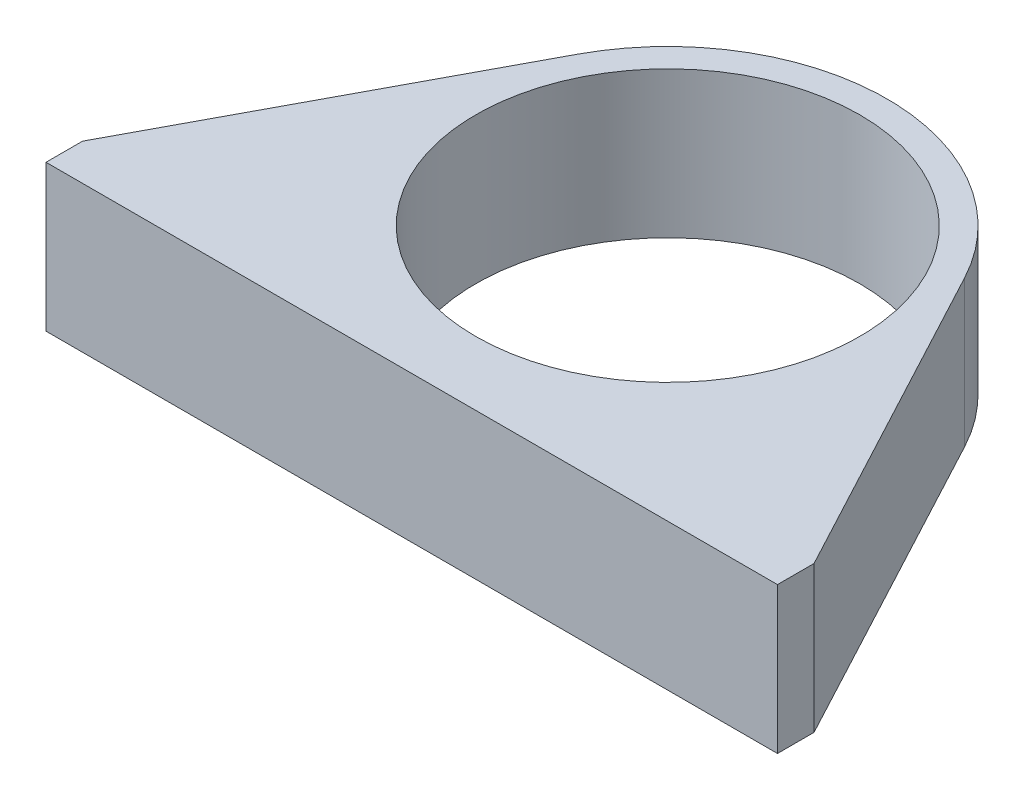
ISO-10303-21;
HEADER;
FILE_DESCRIPTION(('STEP AP214'),'2;1');
FILE_NAME('part.step','',(''),(''),'','','');
FILE_SCHEMA(('AUTOMOTIVE_DESIGN { 1 0 10303 214 1 1 1 1 }'));
ENDSEC;
DATA;
#1=APPLICATION_CONTEXT('core data for automotive mechanical design processes');
#2=APPLICATION_PROTOCOL_DEFINITION('international standard','automotive_design',2000,#1);
#3=PRODUCT_CONTEXT('',#1,'mechanical');
#4=PRODUCT('Part','Part','',(#3));
#5=PRODUCT_RELATED_PRODUCT_CATEGORY('part','',(#4));
#6=PRODUCT_DEFINITION_FORMATION('','',#4);
#7=PRODUCT_DEFINITION_CONTEXT('part definition',#1,'design');
#8=PRODUCT_DEFINITION('design','',#6,#7);
#9=PRODUCT_DEFINITION_SHAPE('','',#8);
#10=(LENGTH_UNIT() NAMED_UNIT(*) SI_UNIT(.MILLI.,.METRE.));
#11=(NAMED_UNIT(*) PLANE_ANGLE_UNIT() SI_UNIT($,.RADIAN.));
#12=(NAMED_UNIT(*) SI_UNIT($,.STERADIAN.) SOLID_ANGLE_UNIT());
#13=UNCERTAINTY_MEASURE_WITH_UNIT(LENGTH_MEASURE(1.E-05),#10,'distance_accuracy_value','');
#14=(GEOMETRIC_REPRESENTATION_CONTEXT(3) GLOBAL_UNCERTAINTY_ASSIGNED_CONTEXT((#13)) GLOBAL_UNIT_ASSIGNED_CONTEXT((#10,
#11,#12)) REPRESENTATION_CONTEXT('',''));
#15=CARTESIAN_POINT('',(0.,0.,0.));
#16=DIRECTION('',(0.,0.,1.));
#17=DIRECTION('',(1.,0.,0.));
#18=AXIS2_PLACEMENT_3D('',#15,#16,#17);
#19=CARTESIAN_POINT('',(26.4705882354013,20.,-14.1176470586226));
#20=DIRECTION('',(-0.882352941180043,0.,0.470588235287419));
#21=DIRECTION('',(0.470588235287419,0.,0.882352941180043));
#22=AXIS2_PLACEMENT_3D('',#19,#20,#21);
#23=PLANE('',#22);
#24=DIRECTION('',(-0.470588235287419,0.,-0.882352941180043));
#25=VECTOR('',#24,1.);
#26=CARTESIAN_POINT('',(26.4705882354013,0.,-14.1176470586226));
#27=LINE('',#26,#25);
#28=CARTESIAN_POINT('',(49.9999999995698,0.,30.));
#29=VERTEX_POINT('',#28);
#30=CARTESIAN_POINT('',(26.4705882354013,0.,-14.1176470586226));
#31=VERTEX_POINT('',#30);
#32=EDGE_CURVE('E119',#29,#31,#27,.T.);
#33=ORIENTED_EDGE('',*,*,#32,.T.);
#34=DIRECTION('',(0.,-1.,0.));
#35=VECTOR('',#34,1.);
#36=CARTESIAN_POINT('',(26.4705882354013,20.,-14.1176470586226));
#37=LINE('',#36,#35);
#38=CARTESIAN_POINT('',(26.4705882354013,20.,-14.1176470586226));
#39=VERTEX_POINT('',#38);
#40=EDGE_CURVE('E11',#39,#31,#37,.T.);
#41=ORIENTED_EDGE('',*,*,#40,.F.);
#42=DIRECTION('',(-0.470588235287419,0.,-0.882352941180043));
#43=VECTOR('',#42,1.);
#44=CARTESIAN_POINT('',(26.4705882354013,20.,-14.1176470586226));
#45=LINE('',#44,#43);
#46=CARTESIAN_POINT('',(49.9999999995698,20.,30.));
#47=VERTEX_POINT('',#46);
#48=EDGE_CURVE('E134',#47,#39,#45,.T.);
#49=ORIENTED_EDGE('',*,*,#48,.F.);
#50=DIRECTION('',(0.,-1.,0.));
#51=VECTOR('',#50,1.);
#52=CARTESIAN_POINT('',(49.9999999995698,20.,30.));
#53=LINE('',#52,#51);
#54=EDGE_CURVE('E51',#47,#29,#53,.T.);
#55=ORIENTED_EDGE('',*,*,#54,.T.);
#56=EDGE_LOOP('',(#33,#41,#49,#55));
#57=FACE_BOUND('',#56,.T.);
#58=ADVANCED_FACE('F35',(#57),#23,.F.);
#59=CARTESIAN_POINT('',(0.,20.,0.));
#60=DIRECTION('',(0.,-1.,0.));
#61=DIRECTION('',(0.,0.,-1.));
#62=AXIS2_PLACEMENT_3D('',#59,#60,#61);
#63=CYLINDRICAL_SURFACE('',#62,30.);
#64=CARTESIAN_POINT('',(0.,0.,0.));
#65=DIRECTION('',(0.,1.,0.));
#66=DIRECTION('',(0.,0.,1.));
#67=AXIS2_PLACEMENT_3D('',#64,#65,#66);
#68=CIRCLE('',#67,30.);
#69=CARTESIAN_POINT('',(-26.4705882351801,0.,-14.1176470590373));
#70=VERTEX_POINT('',#69);
#71=EDGE_CURVE('E121',#31,#70,#68,.T.);
#72=ORIENTED_EDGE('',*,*,#71,.T.);
#73=DIRECTION('',(0.,-1.,0.));
#74=VECTOR('',#73,1.);
#75=CARTESIAN_POINT('',(-26.4705882351801,20.,-14.1176470590373));
#76=LINE('',#75,#74);
#77=CARTESIAN_POINT('',(-26.4705882351801,20.,-14.1176470590373));
#78=VERTEX_POINT('',#77);
#79=EDGE_CURVE('E43',#78,#70,#76,.T.);
#80=ORIENTED_EDGE('',*,*,#79,.F.);
#81=CARTESIAN_POINT('',(0.,20.,0.));
#82=DIRECTION('',(0.,1.,0.));
#83=DIRECTION('',(0.,0.,1.));
#84=AXIS2_PLACEMENT_3D('',#81,#82,#83);
#85=CIRCLE('',#84,30.);
#86=EDGE_CURVE('E84',#39,#78,#85,.T.);
#87=ORIENTED_EDGE('',*,*,#86,.F.);
#88=ORIENTED_EDGE('',*,*,#40,.T.);
#89=EDGE_LOOP('',(#72,#80,#87,#88));
#90=FACE_BOUND('',#89,.T.);
#91=ADVANCED_FACE('F140',(#90),#63,.T.);
#92=CARTESIAN_POINT('',(-26.4705882351801,20.,-14.1176470590373));
#93=DIRECTION('',(-0.88235294117267,0.,-0.470588235301244));
#94=DIRECTION('',(-0.470588235301244,0.,0.88235294117267));
#95=AXIS2_PLACEMENT_3D('',#92,#93,#94);
#96=PLANE('',#95);
#97=DIRECTION('',(0.470588235301244,0.,-0.88235294117267));
#98=VECTOR('',#97,1.);
#99=CARTESIAN_POINT('',(-26.4705882351801,0.,-14.1176470590373));
#100=LINE('',#99,#98);
#101=CARTESIAN_POINT('',(-50.0000000004577,0.,30.));
#102=VERTEX_POINT('',#101);
#103=EDGE_CURVE('E125',#102,#70,#100,.T.);
#104=ORIENTED_EDGE('',*,*,#103,.F.);
#105=DIRECTION('',(0.,-1.,0.));
#106=VECTOR('',#105,1.);
#107=CARTESIAN_POINT('',(-50.0000000004577,20.,30.));
#108=LINE('',#107,#106);
#109=CARTESIAN_POINT('',(-50.0000000004577,20.,30.));
#110=VERTEX_POINT('',#109);
#111=EDGE_CURVE('E111',#110,#102,#108,.T.);
#112=ORIENTED_EDGE('',*,*,#111,.F.);
#113=DIRECTION('',(0.470588235301244,0.,-0.88235294117267));
#114=VECTOR('',#113,1.);
#115=CARTESIAN_POINT('',(-26.4705882351801,20.,-14.1176470590373));
#116=LINE('',#115,#114);
#117=EDGE_CURVE('E101',#110,#78,#116,.T.);
#118=ORIENTED_EDGE('',*,*,#117,.T.);
#119=ORIENTED_EDGE('',*,*,#79,.T.);
#120=EDGE_LOOP('',(#104,#112,#118,#119));
#121=FACE_BOUND('',#120,.T.);
#122=ADVANCED_FACE('F139',(#121),#96,.T.);
#123=CARTESIAN_POINT('',(-50.0000000004577,20.,0.));
#124=DIRECTION('',(1.,0.,0.));
#125=DIRECTION('',(0.,0.,-1.));
#126=AXIS2_PLACEMENT_3D('',#123,#124,#125);
#127=PLANE('',#126);
#128=DIRECTION('',(0.,0.,1.));
#129=VECTOR('',#128,1.);
#130=CARTESIAN_POINT('',(-50.0000000004577,0.,0.));
#131=LINE('',#130,#129);
#132=CARTESIAN_POINT('',(-50.0000000004577,0.,35.));
#133=VERTEX_POINT('',#132);
#134=EDGE_CURVE('E108',#102,#133,#131,.T.);
#135=ORIENTED_EDGE('',*,*,#134,.T.);
#136=DIRECTION('',(0.,-1.,0.));
#137=VECTOR('',#136,1.);
#138=CARTESIAN_POINT('',(-50.0000000004577,20.,35.));
#139=LINE('',#138,#137);
#140=CARTESIAN_POINT('',(-50.0000000004577,20.,35.));
#141=VERTEX_POINT('',#140);
#142=EDGE_CURVE('E105',#141,#133,#139,.T.);
#143=ORIENTED_EDGE('',*,*,#142,.F.);
#144=DIRECTION('',(0.,0.,1.));
#145=VECTOR('',#144,1.);
#146=CARTESIAN_POINT('',(-50.0000000004577,20.,0.));
#147=LINE('',#146,#145);
#148=EDGE_CURVE('E94',#110,#141,#147,.T.);
#149=ORIENTED_EDGE('',*,*,#148,.F.);
#150=ORIENTED_EDGE('',*,*,#111,.T.);
#151=EDGE_LOOP('',(#135,#143,#149,#150));
#152=FACE_BOUND('',#151,.T.);
#153=ADVANCED_FACE('F106',(#152),#127,.F.);
#154=CARTESIAN_POINT('',(0.,20.,35.));
#155=DIRECTION('',(0.,0.,-1.));
#156=DIRECTION('',(-1.,0.,0.));
#157=AXIS2_PLACEMENT_3D('',#154,#155,#156);
#158=PLANE('',#157);
#159=DIRECTION('',(1.,0.,0.));
#160=VECTOR('',#159,1.);
#161=CARTESIAN_POINT('',(0.,0.,35.));
#162=LINE('',#161,#160);
#163=CARTESIAN_POINT('',(49.9999999995698,0.,35.));
#164=VERTEX_POINT('',#163);
#165=EDGE_CURVE('E129',#133,#164,#162,.T.);
#166=ORIENTED_EDGE('',*,*,#165,.T.);
#167=DIRECTION('',(0.,-1.,0.));
#168=VECTOR('',#167,1.);
#169=CARTESIAN_POINT('',(49.9999999995698,20.,35.));
#170=LINE('',#169,#168);
#171=CARTESIAN_POINT('',(49.9999999995698,20.,35.));
#172=VERTEX_POINT('',#171);
#173=EDGE_CURVE('E72',#172,#164,#170,.T.);
#174=ORIENTED_EDGE('',*,*,#173,.F.);
#175=DIRECTION('',(1.,0.,0.));
#176=VECTOR('',#175,1.);
#177=CARTESIAN_POINT('',(0.,20.,35.));
#178=LINE('',#177,#176);
#179=EDGE_CURVE('E99',#141,#172,#178,.T.);
#180=ORIENTED_EDGE('',*,*,#179,.F.);
#181=ORIENTED_EDGE('',*,*,#142,.T.);
#182=EDGE_LOOP('',(#166,#174,#180,#181));
#183=FACE_BOUND('',#182,.T.);
#184=ADVANCED_FACE('F113',(#183),#158,.F.);
#185=CARTESIAN_POINT('',(49.9999999995698,20.,0.));
#186=DIRECTION('',(1.,0.,0.));
#187=DIRECTION('',(0.,0.,-1.));
#188=AXIS2_PLACEMENT_3D('',#185,#186,#187);
#189=PLANE('',#188);
#190=DIRECTION('',(0.,0.,1.));
#191=VECTOR('',#190,1.);
#192=CARTESIAN_POINT('',(49.9999999995698,0.,0.));
#193=LINE('',#192,#191);
#194=EDGE_CURVE('E131',#29,#164,#193,.T.);
#195=ORIENTED_EDGE('',*,*,#194,.F.);
#196=ORIENTED_EDGE('',*,*,#54,.F.);
#197=DIRECTION('',(0.,0.,1.));
#198=VECTOR('',#197,1.);
#199=CARTESIAN_POINT('',(49.9999999995698,20.,0.));
#200=LINE('',#199,#198);
#201=EDGE_CURVE('E114',#47,#172,#200,.T.);
#202=ORIENTED_EDGE('',*,*,#201,.T.);
#203=ORIENTED_EDGE('',*,*,#173,.T.);
#204=EDGE_LOOP('',(#195,#196,#202,#203));
#205=FACE_BOUND('',#204,.T.);
#206=ADVANCED_FACE('F144',(#205),#189,.T.);
#207=CARTESIAN_POINT('',(0.,20.,0.));
#208=DIRECTION('',(0.,1.,0.));
#209=DIRECTION('',(0.,0.,1.));
#210=AXIS2_PLACEMENT_3D('',#207,#208,#209);
#211=PLANE('',#210);
#212=CARTESIAN_POINT('',(0.,20.,0.));
#213=DIRECTION('',(0.,1.,0.));
#214=DIRECTION('',(0.,0.,1.));
#215=AXIS2_PLACEMENT_3D('',#212,#213,#214);
#216=CIRCLE('',#215,26.25);
#217=CARTESIAN_POINT('',(0.,20.,26.25));
#218=VERTEX_POINT('',#217);
#219=EDGE_CURVE('E122',#218,#218,#216,.T.);
#220=ORIENTED_EDGE('',*,*,#219,.F.);
#221=EDGE_LOOP('',(#220));
#222=FACE_BOUND('',#221,.T.);
#223=ORIENTED_EDGE('',*,*,#48,.T.);
#224=ORIENTED_EDGE('',*,*,#86,.T.);
#225=ORIENTED_EDGE('',*,*,#117,.F.);
#226=ORIENTED_EDGE('',*,*,#148,.T.);
#227=ORIENTED_EDGE('',*,*,#179,.T.);
#228=ORIENTED_EDGE('',*,*,#201,.F.);
#229=EDGE_LOOP('',(#223,#224,#225,#226,#227,#228));
#230=FACE_BOUND('',#229,.T.);
#231=ADVANCED_FACE('F96',(#222,#230),#211,.T.);
#232=CARTESIAN_POINT('',(0.,0.,0.));
#233=DIRECTION('',(0.,1.,0.));
#234=DIRECTION('',(0.,0.,1.));
#235=AXIS2_PLACEMENT_3D('',#232,#233,#234);
#236=PLANE('',#235);
#237=CARTESIAN_POINT('',(0.,0.,0.));
#238=DIRECTION('',(0.,1.,0.));
#239=DIRECTION('',(0.,0.,1.));
#240=AXIS2_PLACEMENT_3D('',#237,#238,#239);
#241=CIRCLE('',#240,26.25);
#242=CARTESIAN_POINT('',(0.,0.,26.25));
#243=VERTEX_POINT('',#242);
#244=EDGE_CURVE('E162',#243,#243,#241,.T.);
#245=ORIENTED_EDGE('',*,*,#244,.T.);
#246=EDGE_LOOP('',(#245));
#247=FACE_BOUND('',#246,.T.);
#248=ORIENTED_EDGE('',*,*,#32,.F.);
#249=ORIENTED_EDGE('',*,*,#194,.T.);
#250=ORIENTED_EDGE('',*,*,#165,.F.);
#251=ORIENTED_EDGE('',*,*,#134,.F.);
#252=ORIENTED_EDGE('',*,*,#103,.T.);
#253=ORIENTED_EDGE('',*,*,#71,.F.);
#254=EDGE_LOOP('',(#248,#249,#250,#251,#252,#253));
#255=FACE_BOUND('',#254,.T.);
#256=ADVANCED_FACE('F143',(#247,#255),#236,.F.);
#257=CARTESIAN_POINT('',(0.,20.,0.));
#258=DIRECTION('',(0.,-1.,0.));
#259=DIRECTION('',(0.,0.,-1.));
#260=AXIS2_PLACEMENT_3D('',#257,#258,#259);
#261=CYLINDRICAL_SURFACE('',#260,26.25);
#262=ORIENTED_EDGE('',*,*,#219,.T.);
#263=EDGE_LOOP('',(#262));
#264=FACE_BOUND('',#263,.T.);
#265=ORIENTED_EDGE('',*,*,#244,.F.);
#266=EDGE_LOOP('',(#265));
#267=FACE_BOUND('',#266,.T.);
#268=ADVANCED_FACE('F168',(#264,#267),#261,.F.);
#269=CLOSED_SHELL('',(#58,#91,#122,#153,#184,#206,#231,#256,#268));
#270=MANIFOLD_SOLID_BREP('B2',#269);
#271=ADVANCED_BREP_SHAPE_REPRESENTATION('',(#18,#270),#14);
#272=SHAPE_DEFINITION_REPRESENTATION(#9,#271);
ENDSEC;
END-ISO-10303-21;
